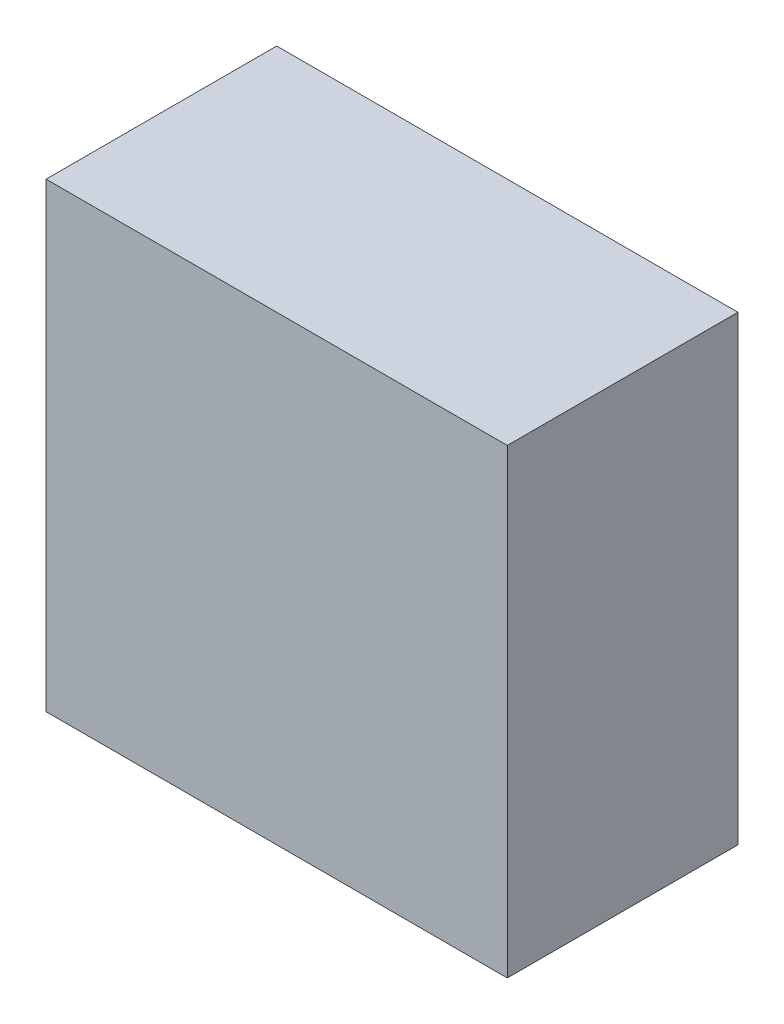
ISO-10303-21;
HEADER;
FILE_DESCRIPTION(('STEP AP214'),'2;1');
FILE_NAME('part.step','',(''),(''),'','','');
FILE_SCHEMA(('AUTOMOTIVE_DESIGN { 1 0 10303 214 1 1 1 1 }'));
ENDSEC;
DATA;
#1=APPLICATION_CONTEXT('core data for automotive mechanical design processes');
#2=APPLICATION_PROTOCOL_DEFINITION('international standard','automotive_design',2000,#1);
#3=PRODUCT_CONTEXT('',#1,'mechanical');
#4=PRODUCT('Part','Part','',(#3));
#5=PRODUCT_RELATED_PRODUCT_CATEGORY('part','',(#4));
#6=PRODUCT_DEFINITION_FORMATION('','',#4);
#7=PRODUCT_DEFINITION_CONTEXT('part definition',#1,'design');
#8=PRODUCT_DEFINITION('design','',#6,#7);
#9=PRODUCT_DEFINITION_SHAPE('','',#8);
#10=(LENGTH_UNIT() NAMED_UNIT(*) SI_UNIT(.MILLI.,.METRE.));
#11=(NAMED_UNIT(*) PLANE_ANGLE_UNIT() SI_UNIT($,.RADIAN.));
#12=(NAMED_UNIT(*) SI_UNIT($,.STERADIAN.) SOLID_ANGLE_UNIT());
#13=UNCERTAINTY_MEASURE_WITH_UNIT(LENGTH_MEASURE(1.E-05),#10,'distance_accuracy_value','');
#14=(GEOMETRIC_REPRESENTATION_CONTEXT(3) GLOBAL_UNCERTAINTY_ASSIGNED_CONTEXT((#13)) GLOBAL_UNIT_ASSIGNED_CONTEXT((#10,
#11,#12)) REPRESENTATION_CONTEXT('',''));
#15=CARTESIAN_POINT('',(0.,0.,0.));
#16=DIRECTION('',(0.,0.,1.));
#17=DIRECTION('',(1.,0.,0.));
#18=AXIS2_PLACEMENT_3D('',#15,#16,#17);
#19=CARTESIAN_POINT('',(0.,0.,2.75));
#20=DIRECTION('',(0.,0.,-1.));
#21=DIRECTION('',(-1.,0.,0.));
#22=AXIS2_PLACEMENT_3D('',#19,#20,#21);
#23=PLANE('',#22);
#24=DIRECTION('',(1.,0.,0.));
#25=VECTOR('',#24,1.);
#26=CARTESIAN_POINT('',(158.313158045853,12.9291158443043,2.75));
#27=LINE('',#26,#25);
#28=CARTESIAN_POINT('',(158.313158045853,12.9291158443043,2.75));
#29=VERTEX_POINT('',#28);
#30=CARTESIAN_POINT('',(154.313158045853,12.9291158443043,2.75));
#31=VERTEX_POINT('',#30);
#32=EDGE_CURVE('E80',#29,#31,#27,.F.);
#33=ORIENTED_EDGE('',*,*,#32,.T.);
#34=DIRECTION('',(0.,1.,0.));
#35=VECTOR('',#34,1.);
#36=CARTESIAN_POINT('',(154.313158045853,12.9291158443043,2.75));
#37=LINE('',#36,#35);
#38=CARTESIAN_POINT('',(154.313158045853,8.92911584430427,2.75));
#39=VERTEX_POINT('',#38);
#40=EDGE_CURVE('E55',#31,#39,#37,.F.);
#41=ORIENTED_EDGE('',*,*,#40,.T.);
#42=DIRECTION('',(1.,0.,0.));
#43=VECTOR('',#42,1.);
#44=CARTESIAN_POINT('',(158.313158045853,8.92911584430427,2.75));
#45=LINE('',#44,#43);
#46=CARTESIAN_POINT('',(158.313158045853,8.92911584430427,2.75));
#47=VERTEX_POINT('',#46);
#48=EDGE_CURVE('E57',#39,#47,#45,.T.);
#49=ORIENTED_EDGE('',*,*,#48,.T.);
#50=DIRECTION('',(0.,1.,0.));
#51=VECTOR('',#50,1.);
#52=CARTESIAN_POINT('',(158.313158045853,12.9291158443043,2.75));
#53=LINE('',#52,#51);
#54=EDGE_CURVE('E20',#47,#29,#53,.T.);
#55=ORIENTED_EDGE('',*,*,#54,.T.);
#56=EDGE_LOOP('',(#33,#41,#49,#55));
#57=FACE_BOUND('',#56,.T.);
#58=ADVANCED_FACE('F17',(#57),#23,.F.);
#59=CARTESIAN_POINT('',(158.313158045853,12.9291158443043,2.75));
#60=DIRECTION('',(-1.,0.,0.));
#61=DIRECTION('',(0.,0.,1.));
#62=AXIS2_PLACEMENT_3D('',#59,#60,#61);
#63=PLANE('',#62);
#64=DIRECTION('',(0.,0.,-1.));
#65=VECTOR('',#64,1.);
#66=CARTESIAN_POINT('',(158.313158045853,12.9291158443043,2.75));
#67=LINE('',#66,#65);
#68=CARTESIAN_POINT('',(158.313158045853,12.9291158443043,0.75));
#69=VERTEX_POINT('',#68);
#70=EDGE_CURVE('E68',#69,#29,#67,.F.);
#71=ORIENTED_EDGE('',*,*,#70,.T.);
#72=ORIENTED_EDGE('',*,*,#54,.F.);
#73=DIRECTION('',(0.,0.,1.));
#74=VECTOR('',#73,1.);
#75=CARTESIAN_POINT('',(158.313158045853,8.92911584430427,2.75));
#76=LINE('',#75,#74);
#77=CARTESIAN_POINT('',(158.313158045853,8.92911584430427,0.75));
#78=VERTEX_POINT('',#77);
#79=EDGE_CURVE('E63',#47,#78,#76,.F.);
#80=ORIENTED_EDGE('',*,*,#79,.T.);
#81=DIRECTION('',(0.,1.,0.));
#82=VECTOR('',#81,1.);
#83=CARTESIAN_POINT('',(158.313158045853,0.,0.75));
#84=LINE('',#83,#82);
#85=EDGE_CURVE('E83',#69,#78,#84,.F.);
#86=ORIENTED_EDGE('',*,*,#85,.F.);
#87=EDGE_LOOP('',(#71,#72,#80,#86));
#88=FACE_BOUND('',#87,.T.);
#89=ADVANCED_FACE('F65',(#88),#63,.F.);
#90=CARTESIAN_POINT('',(158.313158045853,8.92911584430427,2.75));
#91=DIRECTION('',(0.,1.,0.));
#92=DIRECTION('',(0.,0.,1.));
#93=AXIS2_PLACEMENT_3D('',#90,#91,#92);
#94=PLANE('',#93);
#95=ORIENTED_EDGE('',*,*,#79,.F.);
#96=ORIENTED_EDGE('',*,*,#48,.F.);
#97=DIRECTION('',(0.,0.,-1.));
#98=VECTOR('',#97,1.);
#99=CARTESIAN_POINT('',(154.313158045853,8.92911584430427,2.75));
#100=LINE('',#99,#98);
#101=CARTESIAN_POINT('',(154.313158045853,8.92911584430427,0.75));
#102=VERTEX_POINT('',#101);
#103=EDGE_CURVE('E75',#39,#102,#100,.T.);
#104=ORIENTED_EDGE('',*,*,#103,.T.);
#105=DIRECTION('',(-1.,0.,0.));
#106=VECTOR('',#105,1.);
#107=CARTESIAN_POINT('',(0.,8.92911584430427,0.75));
#108=LINE('',#107,#106);
#109=EDGE_CURVE('E72',#78,#102,#108,.T.);
#110=ORIENTED_EDGE('',*,*,#109,.F.);
#111=EDGE_LOOP('',(#95,#96,#104,#110));
#112=FACE_BOUND('',#111,.T.);
#113=ADVANCED_FACE('F70',(#112),#94,.F.);
#114=CARTESIAN_POINT('',(154.313158045853,12.9291158443043,2.75));
#115=DIRECTION('',(1.,0.,0.));
#116=DIRECTION('',(0.,0.,-1.));
#117=AXIS2_PLACEMENT_3D('',#114,#115,#116);
#118=PLANE('',#117);
#119=ORIENTED_EDGE('',*,*,#103,.F.);
#120=ORIENTED_EDGE('',*,*,#40,.F.);
#121=DIRECTION('',(0.,0.,-1.));
#122=VECTOR('',#121,1.);
#123=CARTESIAN_POINT('',(154.313158045853,12.9291158443043,2.75));
#124=LINE('',#123,#122);
#125=CARTESIAN_POINT('',(154.313158045853,12.9291158443043,0.75));
#126=VERTEX_POINT('',#125);
#127=EDGE_CURVE('E35',#31,#126,#124,.T.);
#128=ORIENTED_EDGE('',*,*,#127,.T.);
#129=DIRECTION('',(0.,1.,0.));
#130=VECTOR('',#129,1.);
#131=CARTESIAN_POINT('',(154.313158045853,0.,0.75));
#132=LINE('',#131,#130);
#133=EDGE_CURVE('E26',#102,#126,#132,.T.);
#134=ORIENTED_EDGE('',*,*,#133,.F.);
#135=EDGE_LOOP('',(#119,#120,#128,#134));
#136=FACE_BOUND('',#135,.T.);
#137=ADVANCED_FACE('F89',(#136),#118,.F.);
#138=CARTESIAN_POINT('',(158.313158045853,12.9291158443043,2.75));
#139=DIRECTION('',(0.,-1.,0.));
#140=DIRECTION('',(0.,0.,-1.));
#141=AXIS2_PLACEMENT_3D('',#138,#139,#140);
#142=PLANE('',#141);
#143=ORIENTED_EDGE('',*,*,#127,.F.);
#144=ORIENTED_EDGE('',*,*,#32,.F.);
#145=ORIENTED_EDGE('',*,*,#70,.F.);
#146=DIRECTION('',(-1.,0.,0.));
#147=VECTOR('',#146,1.);
#148=CARTESIAN_POINT('',(0.,12.9291158443043,0.75));
#149=LINE('',#148,#147);
#150=EDGE_CURVE('E11',#126,#69,#149,.F.);
#151=ORIENTED_EDGE('',*,*,#150,.F.);
#152=EDGE_LOOP('',(#143,#144,#145,#151));
#153=FACE_BOUND('',#152,.T.);
#154=ADVANCED_FACE('F91',(#153),#142,.F.);
#155=CARTESIAN_POINT('',(0.,0.,0.75));
#156=DIRECTION('',(0.,0.,-1.));
#157=DIRECTION('',(-1.,0.,0.));
#158=AXIS2_PLACEMENT_3D('',#155,#156,#157);
#159=PLANE('',#158);
#160=ORIENTED_EDGE('',*,*,#133,.T.);
#161=ORIENTED_EDGE('',*,*,#150,.T.);
#162=ORIENTED_EDGE('',*,*,#85,.T.);
#163=ORIENTED_EDGE('',*,*,#109,.T.);
#164=EDGE_LOOP('',(#160,#161,#162,#163));
#165=FACE_BOUND('',#164,.T.);
#166=ADVANCED_FACE('F88',(#165),#159,.T.);
#167=CLOSED_SHELL('',(#58,#89,#113,#137,#154,#166));
#168=MANIFOLD_SOLID_BREP('B1',#167);
#169=ADVANCED_BREP_SHAPE_REPRESENTATION('',(#18,#168),#14);
#170=SHAPE_DEFINITION_REPRESENTATION(#9,#169);
ENDSEC;
END-ISO-10303-21;
